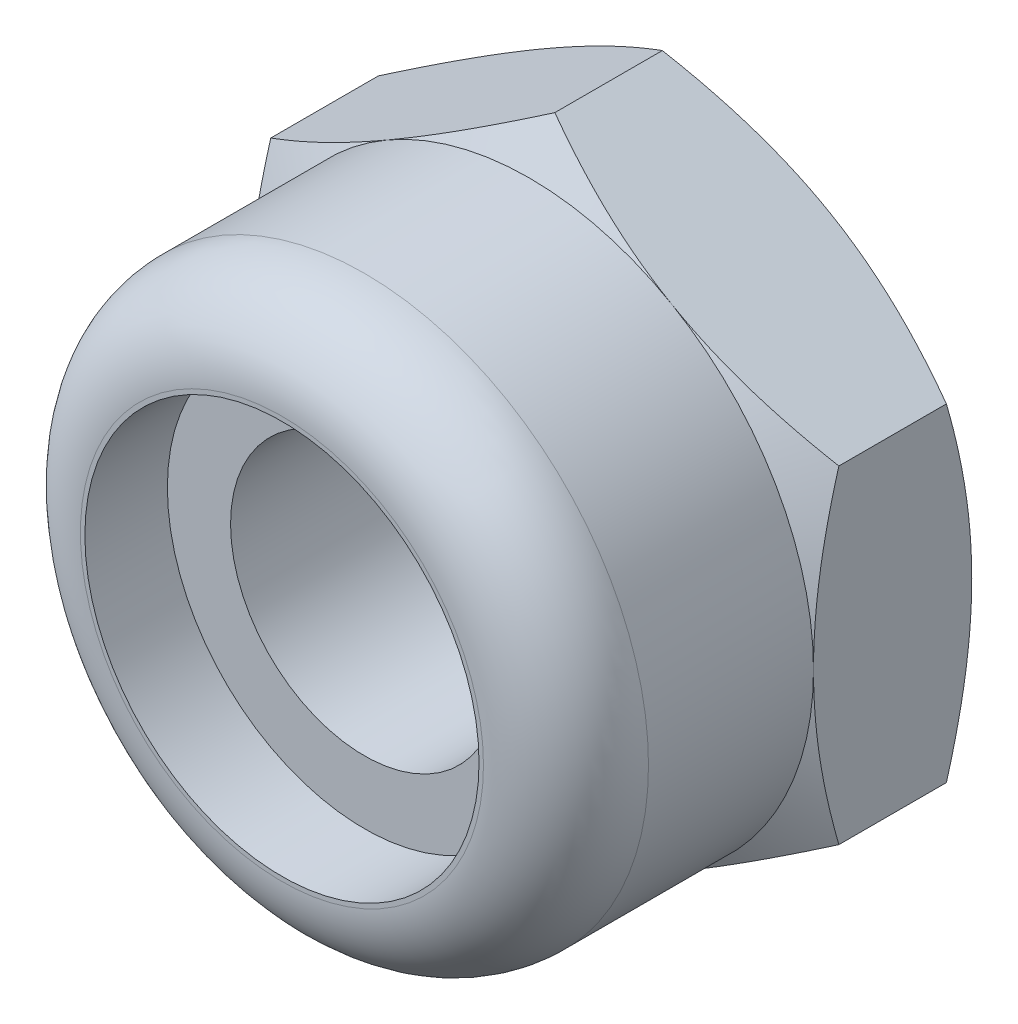
ISO-10303-21;
HEADER;
FILE_DESCRIPTION(('STEP AP214'),'2;1');
FILE_NAME('part.step','',(''),(''),'','','');
FILE_SCHEMA(('AUTOMOTIVE_DESIGN { 1 0 10303 214 1 1 1 1 }'));
ENDSEC;
DATA;
#1=APPLICATION_CONTEXT('core data for automotive mechanical design processes');
#2=APPLICATION_PROTOCOL_DEFINITION('international standard','automotive_design',2000,#1);
#3=PRODUCT_CONTEXT('',#1,'mechanical');
#4=PRODUCT('Part','Part','',(#3));
#5=PRODUCT_RELATED_PRODUCT_CATEGORY('part','',(#4));
#6=PRODUCT_DEFINITION_FORMATION('','',#4);
#7=PRODUCT_DEFINITION_CONTEXT('part definition',#1,'design');
#8=PRODUCT_DEFINITION('design','',#6,#7);
#9=PRODUCT_DEFINITION_SHAPE('','',#8);
#10=(LENGTH_UNIT() NAMED_UNIT(*) SI_UNIT(.MILLI.,.METRE.));
#11=(NAMED_UNIT(*) PLANE_ANGLE_UNIT() SI_UNIT($,.RADIAN.));
#12=(NAMED_UNIT(*) SI_UNIT($,.STERADIAN.) SOLID_ANGLE_UNIT());
#13=UNCERTAINTY_MEASURE_WITH_UNIT(LENGTH_MEASURE(1.E-05),#10,'distance_accuracy_value','');
#14=(GEOMETRIC_REPRESENTATION_CONTEXT(3) GLOBAL_UNCERTAINTY_ASSIGNED_CONTEXT((#13)) GLOBAL_UNIT_ASSIGNED_CONTEXT((#10,
#11,#12)) REPRESENTATION_CONTEXT('',''));
#15=CARTESIAN_POINT('',(0.,0.,0.));
#16=DIRECTION('',(0.,0.,1.));
#17=DIRECTION('',(1.,0.,0.));
#18=AXIS2_PLACEMENT_3D('',#15,#16,#17);
#19=CARTESIAN_POINT('',(0.,0.,-1.95));
#20=DIRECTION('',(0.,0.,1.));
#21=DIRECTION('',(1.,0.,0.));
#22=AXIS2_PLACEMENT_3D('',#19,#20,#21);
#23=CYLINDRICAL_SURFACE('',#22,1.65);
#24=CARTESIAN_POINT('',(0.,0.,2.033333333333));
#25=DIRECTION('',(0.,0.,1.));
#26=DIRECTION('',(1.,0.,0.));
#27=AXIS2_PLACEMENT_3D('',#24,#25,#26);
#28=CIRCLE('',#27,1.65);
#29=CARTESIAN_POINT('',(1.65,0.,2.033333333333));
#30=VERTEX_POINT('',#29);
#31=EDGE_CURVE('E285',#30,#30,#28,.T.);
#32=ORIENTED_EDGE('',*,*,#31,.T.);
#33=EDGE_LOOP('',(#32));
#34=FACE_BOUND('',#33,.T.);
#35=CARTESIAN_POINT('',(0.,0.,-1.6795273616266));
#36=DIRECTION('',(0.,0.,-1.));
#37=DIRECTION('',(-1.,0.,0.));
#38=AXIS2_PLACEMENT_3D('',#35,#36,#37);
#39=CIRCLE('',#38,1.65);
#40=CARTESIAN_POINT('',(-1.65,0.,-1.6795273616266));
#41=VERTEX_POINT('',#40);
#42=EDGE_CURVE('E44',#41,#41,#39,.F.);
#43=ORIENTED_EDGE('',*,*,#42,.F.);
#44=EDGE_LOOP('',(#43));
#45=FACE_BOUND('',#44,.T.);
#46=ADVANCED_FACE('F39',(#34,#45),#23,.F.);
#47=CARTESIAN_POINT('',(0.,4.04145188432738,-1.95));
#48=DIRECTION('',(-0.500000000000001,0.866025403784438,0.));
#49=DIRECTION('',(-0.866025403784438,-0.500000000000001,0.));
#50=AXIS2_PLACEMENT_3D('',#47,#48,#49);
#51=PLANE('',#50);
#52=DIRECTION('',(0.,0.,1.));
#53=VECTOR('',#52,1.);
#54=CARTESIAN_POINT('',(-3.5,2.02072594216369,-1.95));
#55=LINE('',#54,#53);
#56=CARTESIAN_POINT('',(-3.5,2.02072594216369,-1.63739260883035));
#57=VERTEX_POINT('',#56);
#58=CARTESIAN_POINT('',(-3.5,2.02072594216369,-0.312607391169643));
#59=VERTEX_POINT('',#58);
#60=EDGE_CURVE('E258',#57,#59,#55,.T.);
#61=ORIENTED_EDGE('',*,*,#60,.T.);
#62=CARTESIAN_POINT('',(-3.5002,2.02061047210985,-0.312674060693371));
#63=CARTESIAN_POINT('',(-3.34639282154755,2.10941108799267,-0.261385788989984));
#64=CARTESIAN_POINT('',(-3.19125798916558,2.19897822522909,-0.214740953816197));
#65=CARTESIAN_POINT('',(-2.87830199342322,2.37966345361545,-0.133321875533349));
#66=CARTESIAN_POINT('',(-2.7204752692125,2.47078475532382,-0.0985764355845609));
#67=CARTESIAN_POINT('',(-2.40677778961987,2.65189807961073,-0.0444900271828354));
#68=CARTESIAN_POINT('',(-2.25095530083931,2.74186223545399,-0.0247890862603809));
#69=CARTESIAN_POINT('',(-1.93857711279463,2.92221386641056,-0.00127013273725393));
#70=CARTESIAN_POINT('',(-1.78202254896577,3.01260068598001,0.00256735545443503));
#71=CARTESIAN_POINT('',(-1.48949078007901,3.1814939814933,-0.00541530187697759));
#72=CARTESIAN_POINT('',(-1.35346978754209,3.26002573814993,-0.0152754340696071));
#73=CARTESIAN_POINT('',(-1.08231397971101,3.41657761679354,-0.0465264668994038));
#74=CARTESIAN_POINT('',(-0.947180102315317,3.49459719728458,-0.0679280432857987));
#75=CARTESIAN_POINT('',(-0.675465207594816,3.65147186489429,-0.121430407880578));
#76=CARTESIAN_POINT('',(-0.538918580721664,3.73030709667644,-0.153757994445088));
#77=CARTESIAN_POINT('',(-0.267861907055498,3.88680174018324,-0.227128933807996));
#78=CARTESIAN_POINT('',(-0.133348387531463,3.96446315689009,-0.268155046569868));
#79=CARTESIAN_POINT('',(0.000200000000000561,4.04156735438122,-0.312674060693373));
#80=B_SPLINE_CURVE_WITH_KNOTS('',3,(#62,#63,#64,#65,#66,#67,#68,#69,#70,#71,#72,#73,#74,#75,#76,
#77,#78,#79),.UNSPECIFIED.,.F.,.F.,(4,2,2,2,2,2,2,2,4),(0.,0.554793832886254,1.11092123814984,
1.65328467083219,2.19498204478403,2.6666513085086,3.13875761298267,3.6213361260051,
4.10296698719187),.UNSPECIFIED.);
#81=CARTESIAN_POINT('',(-1.75,3.03108891324553,0.));
#82=VERTEX_POINT('',#81);
#83=EDGE_CURVE('E64',#59,#82,#80,.T.);
#84=ORIENTED_EDGE('',*,*,#83,.T.);
#85=CARTESIAN_POINT('',(0.,4.04145188432738,-0.312607391169645));
#86=VERTEX_POINT('',#85);
#87=EDGE_CURVE('E207',#82,#86,#80,.T.);
#88=ORIENTED_EDGE('',*,*,#87,.T.);
#89=DIRECTION('',(0.,0.,1.));
#90=VECTOR('',#89,1.);
#91=CARTESIAN_POINT('',(0.,4.04145188432738,-1.95));
#92=LINE('',#91,#90);
#93=CARTESIAN_POINT('',(0.,4.04145188432738,-1.63739260883035));
#94=VERTEX_POINT('',#93);
#95=EDGE_CURVE('E244',#94,#86,#92,.T.);
#96=ORIENTED_EDGE('',*,*,#95,.F.);
#97=CARTESIAN_POINT('',(-3.5002,2.02061047210985,-1.63732593930663));
#98=CARTESIAN_POINT('',(-3.34639282154755,2.10941108799267,-1.68861421101002));
#99=CARTESIAN_POINT('',(-3.19125798916558,2.19897822522909,-1.7352590461838));
#100=CARTESIAN_POINT('',(-2.87830199342322,2.37966345361545,-1.81667812446665));
#101=CARTESIAN_POINT('',(-2.7204752692125,2.47078475532382,-1.85142356441544));
#102=CARTESIAN_POINT('',(-2.40677778961987,2.65189807961073,-1.90550997281716));
#103=CARTESIAN_POINT('',(-2.25095530083931,2.74186223545399,-1.92521091373962));
#104=CARTESIAN_POINT('',(-1.93857711279463,2.92221386641056,-1.94872986726275));
#105=CARTESIAN_POINT('',(-1.78202254896577,3.01260068598001,-1.95256735545444));
#106=CARTESIAN_POINT('',(-1.48949078007901,3.1814939814933,-1.94458469812302));
#107=CARTESIAN_POINT('',(-1.35346978754209,3.26002573814993,-1.93472456593039));
#108=CARTESIAN_POINT('',(-1.08231397971101,3.41657761679354,-1.9034735331006));
#109=CARTESIAN_POINT('',(-0.947180102315317,3.49459719728458,-1.8820719567142));
#110=CARTESIAN_POINT('',(-0.675465207594816,3.65147186489429,-1.82856959211942));
#111=CARTESIAN_POINT('',(-0.538918580721664,3.73030709667644,-1.79624200555491));
#112=CARTESIAN_POINT('',(-0.267861907055498,3.88680174018324,-1.722871066192));
#113=CARTESIAN_POINT('',(-0.133348387531463,3.96446315689009,-1.68184495343013));
#114=CARTESIAN_POINT('',(0.000200000000000564,4.04156735438122,-1.63732593930663));
#115=B_SPLINE_CURVE_WITH_KNOTS('',3,(#97,#98,#99,#100,#101,#102,#103,#104,#105,#106,#107,#108,
#109,#110,#111,#112,#113,#114),.UNSPECIFIED.,.F.,.F.,(4,2,2,2,2,2,2,2,4),(0.,0.554793832886254,
1.11092123814984,1.65328467083219,2.19498204478403,2.6666513085086,3.13875761298267,
3.6213361260051,4.10296698719187),.UNSPECIFIED.);
#116=CARTESIAN_POINT('',(-1.75,3.03108891324553,-1.95));
#117=VERTEX_POINT('',#116);
#118=EDGE_CURVE('E260',#117,#94,#115,.T.);
#119=ORIENTED_EDGE('',*,*,#118,.F.);
#120=EDGE_CURVE('E238',#57,#117,#115,.T.);
#121=ORIENTED_EDGE('',*,*,#120,.F.);
#122=EDGE_LOOP('',(#61,#84,#88,#96,#119,#121));
#123=FACE_BOUND('',#122,.T.);
#124=ADVANCED_FACE('F41',(#123),#51,.T.);
#125=CARTESIAN_POINT('',(3.5,2.02072594216369,-1.95));
#126=DIRECTION('',(0.500000000000001,0.866025403784438,0.));
#127=DIRECTION('',(-0.866025403784438,0.500000000000001,0.));
#128=AXIS2_PLACEMENT_3D('',#125,#126,#127);
#129=PLANE('',#128);
#130=ORIENTED_EDGE('',*,*,#95,.T.);
#131=CARTESIAN_POINT('',(-0.000199999999999286,4.04156735438122,-0.312674060693373));
#132=CARTESIAN_POINT('',(0.15360717845245,3.9527667384984,-0.261385788989985));
#133=CARTESIAN_POINT('',(0.308742010834425,3.86319960126198,-0.214740953816199));
#134=CARTESIAN_POINT('',(0.621698006576782,3.68251437287562,-0.13332187553335));
#135=CARTESIAN_POINT('',(0.779524730787497,3.59139307116725,-0.098576435584562));
#136=CARTESIAN_POINT('',(1.09322221038013,3.41027974688034,-0.044490027182836));
#137=CARTESIAN_POINT('',(1.24904469916069,3.32031559103708,-0.0247890862603812));
#138=CARTESIAN_POINT('',(1.56142288720538,3.13996396008051,-0.00127013273725366));
#139=CARTESIAN_POINT('',(1.71797745103423,3.04957714051106,0.00256735545443554));
#140=CARTESIAN_POINT('',(2.01050921992099,2.88068384499777,-0.00541530187697695));
#141=CARTESIAN_POINT('',(2.14653021245791,2.80215208834114,-0.0152754340696064));
#142=CARTESIAN_POINT('',(2.417686020289,2.64560020969753,-0.0465264668994028));
#143=CARTESIAN_POINT('',(2.55281989768468,2.56758062920649,-0.0679280432857974));
#144=CARTESIAN_POINT('',(2.82453479240518,2.41070596159678,-0.121430407880577));
#145=CARTESIAN_POINT('',(2.96108141927834,2.33187072981463,-0.153757994445086));
#146=CARTESIAN_POINT('',(3.2321380929445,2.17537608630783,-0.227128933807994));
#147=CARTESIAN_POINT('',(3.36665161246854,2.09771466960098,-0.268155046569867));
#148=CARTESIAN_POINT('',(3.5002,2.02061047210985,-0.312674060693371));
#149=B_SPLINE_CURVE_WITH_KNOTS('',3,(#131,#132,#133,#134,#135,#136,#137,#138,#139,#140,#141,
#142,#143,#144,#145,#146,#147,#148),.UNSPECIFIED.,.F.,.F.,(4,2,2,2,2,2,2,2,4),(0.,
0.554793832886254,1.11092123814984,1.65328467083219,2.19498204478403,2.6666513085086,
3.13875761298267,3.6213361260051,4.10296698719187),.UNSPECIFIED.);
#150=CARTESIAN_POINT('',(1.75,3.03108891324553,0.));
#151=VERTEX_POINT('',#150);
#152=EDGE_CURVE('E216',#86,#151,#149,.T.);
#153=ORIENTED_EDGE('',*,*,#152,.T.);
#154=CARTESIAN_POINT('',(3.5,2.02072594216369,-0.312607391169645));
#155=VERTEX_POINT('',#154);
#156=EDGE_CURVE('E208',#151,#155,#149,.T.);
#157=ORIENTED_EDGE('',*,*,#156,.T.);
#158=DIRECTION('',(0.,0.,1.));
#159=VECTOR('',#158,1.);
#160=CARTESIAN_POINT('',(3.5,2.02072594216369,-1.95));
#161=LINE('',#160,#159);
#162=CARTESIAN_POINT('',(3.5,2.02072594216369,-1.63739260883035));
#163=VERTEX_POINT('',#162);
#164=EDGE_CURVE('E248',#163,#155,#161,.T.);
#165=ORIENTED_EDGE('',*,*,#164,.F.);
#166=CARTESIAN_POINT('',(-0.000199999999999315,4.04156735438122,-1.63732593930663));
#167=CARTESIAN_POINT('',(0.15360717845245,3.9527667384984,-1.68861421101001));
#168=CARTESIAN_POINT('',(0.308742010834425,3.86319960126198,-1.7352590461838));
#169=CARTESIAN_POINT('',(0.621698006576782,3.68251437287562,-1.81667812446665));
#170=CARTESIAN_POINT('',(0.779524730787497,3.59139307116725,-1.85142356441544));
#171=CARTESIAN_POINT('',(1.09322221038013,3.41027974688034,-1.90550997281716));
#172=CARTESIAN_POINT('',(1.24904469916069,3.32031559103708,-1.92521091373962));
#173=CARTESIAN_POINT('',(1.56142288720538,3.13996396008051,-1.94872986726275));
#174=CARTESIAN_POINT('',(1.71797745103423,3.04957714051106,-1.95256735545444));
#175=CARTESIAN_POINT('',(2.01050921992099,2.88068384499777,-1.94458469812302));
#176=CARTESIAN_POINT('',(2.14653021245791,2.80215208834114,-1.93472456593039));
#177=CARTESIAN_POINT('',(2.417686020289,2.64560020969753,-1.9034735331006));
#178=CARTESIAN_POINT('',(2.55281989768468,2.56758062920649,-1.8820719567142));
#179=CARTESIAN_POINT('',(2.82453479240518,2.41070596159678,-1.82856959211942));
#180=CARTESIAN_POINT('',(2.96108141927834,2.33187072981463,-1.79624200555491));
#181=CARTESIAN_POINT('',(3.2321380929445,2.17537608630783,-1.72287106619201));
#182=CARTESIAN_POINT('',(3.36665161246854,2.09771466960098,-1.68184495343013));
#183=CARTESIAN_POINT('',(3.5002,2.02061047210985,-1.63732593930663));
#184=B_SPLINE_CURVE_WITH_KNOTS('',3,(#166,#167,#168,#169,#170,#171,#172,#173,#174,#175,#176,
#177,#178,#179,#180,#181,#182,#183),.UNSPECIFIED.,.F.,.F.,(4,2,2,2,2,2,2,2,4),(0.,
0.554793832886254,1.11092123814984,1.65328467083219,2.19498204478403,2.6666513085086,
3.13875761298267,3.6213361260051,4.10296698719187),.UNSPECIFIED.);
#185=CARTESIAN_POINT('',(1.75,3.03108891324553,-1.95));
#186=VERTEX_POINT('',#185);
#187=EDGE_CURVE('E229',#186,#163,#184,.T.);
#188=ORIENTED_EDGE('',*,*,#187,.F.);
#189=EDGE_CURVE('E236',#94,#186,#184,.T.);
#190=ORIENTED_EDGE('',*,*,#189,.F.);
#191=EDGE_LOOP('',(#130,#153,#157,#165,#188,#190));
#192=FACE_BOUND('',#191,.T.);
#193=ADVANCED_FACE('F219',(#192),#129,.T.);
#194=CARTESIAN_POINT('',(3.5,2.02072594216369,-1.95));
#195=DIRECTION('',(-1.,0.,0.));
#196=DIRECTION('',(0.,0.,1.));
#197=AXIS2_PLACEMENT_3D('',#194,#195,#196);
#198=PLANE('',#197);
#199=CARTESIAN_POINT('',(3.5,-5.35926299121406,-1.67484346858556));
#200=CARTESIAN_POINT('',(3.5,-5.20559319908842,-1.60058173692104));
#201=CARTESIAN_POINT('',(3.5,-5.05156008083376,-1.52705822833148));
#202=CARTESIAN_POINT('',(3.5,-4.7425707418071,-1.38190950344752));
#203=CARTESIAN_POINT('',(3.5,-4.58761436682437,-1.31028461582133));
#204=CARTESIAN_POINT('',(3.5,-4.27574500225542,-1.16897765517624));
#205=CARTESIAN_POINT('',(3.5,-4.11882589028192,-1.09930904568016));
#206=CARTESIAN_POINT('',(3.5,-3.80369792903856,-0.962964262242764));
#207=CARTESIAN_POINT('',(3.5,-3.64548914750596,-0.896287932319521));
#208=CARTESIAN_POINT('',(3.5,-3.32556618401856,-0.765931819095069));
#209=CARTESIAN_POINT('',(3.5,-3.16383281219924,-0.702298873688867));
#210=CARTESIAN_POINT('',(3.5,-2.83845840945598,-0.580016702089494));
#211=CARTESIAN_POINT('',(3.5,-2.67481716858826,-0.521368030370693));
#212=CARTESIAN_POINT('',(3.5,-2.3457027847205,-0.410630279877023));
#213=CARTESIAN_POINT('',(3.5,-2.18023438248743,-0.358527255435859));
#214=CARTESIAN_POINT('',(3.5,-1.8469452280637,-0.262572936976444));
#215=CARTESIAN_POINT('',(3.5,-1.6791252378753,-0.218719033467158));
#216=CARTESIAN_POINT('',(3.5,-1.34101828610925,-0.141391945584787));
#217=CARTESIAN_POINT('',(3.5,-1.17073068027694,-0.107921525211973));
#218=CARTESIAN_POINT('',(3.5,-0.828102385138485,-0.0536149564320504));
#219=CARTESIAN_POINT('',(3.5,-0.655761694017302,-0.0327788191952365));
#220=CARTESIAN_POINT('',(3.5,-0.31102049092445,-0.00558408650575669));
#221=CARTESIAN_POINT('',(3.5,-0.13862739720726,0.00086616316591122));
#222=CARTESIAN_POINT('',(3.5,0.206038074906534,-0.00105355807794606));
#223=CARTESIAN_POINT('',(3.5,0.378310473023179,-0.00941968196343173));
#224=CARTESIAN_POINT('',(3.5,0.672490555822326,-0.0357688927868919));
#225=CARTESIAN_POINT('',(3.5,0.794722791084091,-0.0503206340384212));
#226=CARTESIAN_POINT('',(3.5,1.0382430543056,-0.0859367340533556));
#227=CARTESIAN_POINT('',(3.5,1.15953093025886,-0.107002119926141));
#228=CARTESIAN_POINT('',(3.5,1.52187914771348,-0.178863187081452));
#229=CARTESIAN_POINT('',(3.5,1.76124104212632,-0.23830527562201));
#230=CARTESIAN_POINT('',(3.5,2.11940971387708,-0.340826814402553));
#231=CARTESIAN_POINT('',(3.5,2.24008344316346,-0.377749699085182));
#232=CARTESIAN_POINT('',(3.5,2.48017139213728,-0.455249007699292));
#233=CARTESIAN_POINT('',(3.5,2.59958641795612,-0.495822911663549));
#234=CARTESIAN_POINT('',(3.5,2.83665760451798,-0.579779986782752));
#235=CARTESIAN_POINT('',(3.5,2.95431988203483,-0.623146060034313));
#236=CARTESIAN_POINT('',(3.5,3.188731535088,-0.712423559566865));
#237=CARTESIAN_POINT('',(3.5,3.30548051959464,-0.758336014592949));
#238=CARTESIAN_POINT('',(3.5,3.42180736613349,-0.80527038072407));
#239=B_SPLINE_CURVE_WITH_KNOTS('',3,(#199,#200,#201,#202,#203,#204,#205,#206,#207,#208,#209,
#210,#211,#212,#213,#214,#215,#216,#217,#218,#219,#220,#221,#222,#223,#224,#225,#226,#227,#228,
#229,#230,#231,#232,#233,#234,#235,#236,#237,#238),.UNSPECIFIED.,.F.,.F.,(4,2,2,2,2,2,2,2,2,2,2,
2,2,2,2,2,2,2,2,4),(0.,0.512025318465737,1.02413870177436,1.53918270315241,2.05419982499223,
2.57553975872798,3.09693761309353,3.617205066104,4.13730766217537,4.65754858684365,
5.17778997146961,5.69470725122282,6.21149033452401,6.58059623222331,6.94976036239485,
7.68863804939851,8.06719621660478,8.4454950747676,8.82166461280099,9.1979872473341),.UNSPECIFIED.);
#240=CARTESIAN_POINT('',(3.5,-2.0207259421637,-0.312607391169645));
#241=VERTEX_POINT('',#240);
#242=CARTESIAN_POINT('',(3.5,0.,0.));
#243=VERTEX_POINT('',#242);
#244=EDGE_CURVE('E195',#241,#243,#239,.T.);
#245=ORIENTED_EDGE('',*,*,#244,.F.);
#246=DIRECTION('',(0.,0.,1.));
#247=VECTOR('',#246,1.);
#248=CARTESIAN_POINT('',(3.5,-2.0207259421637,-1.95));
#249=LINE('',#248,#247);
#250=CARTESIAN_POINT('',(3.5,-2.0207259421637,-1.63739260883035));
#251=VERTEX_POINT('',#250);
#252=EDGE_CURVE('E251',#251,#241,#249,.T.);
#253=ORIENTED_EDGE('',*,*,#252,.F.);
#254=CARTESIAN_POINT('',(3.5,-5.35926299121406,-0.275156531414437));
#255=CARTESIAN_POINT('',(3.5,-5.20559319908842,-0.34941826307896));
#256=CARTESIAN_POINT('',(3.5,-5.05156008083376,-0.422941771668524));
#257=CARTESIAN_POINT('',(3.5,-4.7425707418071,-0.568090496552479));
#258=CARTESIAN_POINT('',(3.5,-4.58761436682437,-0.63971538417867));
#259=CARTESIAN_POINT('',(3.5,-4.27574500225542,-0.781022344823759));
#260=CARTESIAN_POINT('',(3.5,-4.11882589028192,-0.850690954319838));
#261=CARTESIAN_POINT('',(3.5,-3.80369792903856,-0.987035737757236));
#262=CARTESIAN_POINT('',(3.5,-3.64548914750596,-1.05371206768048));
#263=CARTESIAN_POINT('',(3.5,-3.32556618401856,-1.18406818090493));
#264=CARTESIAN_POINT('',(3.5,-3.16383281219924,-1.24770112631113));
#265=CARTESIAN_POINT('',(3.5,-2.83845840945598,-1.36998329791051));
#266=CARTESIAN_POINT('',(3.5,-2.67481716858826,-1.42863196962931));
#267=CARTESIAN_POINT('',(3.5,-2.3457027847205,-1.53936972012298));
#268=CARTESIAN_POINT('',(3.5,-2.18023438248743,-1.59147274456414));
#269=CARTESIAN_POINT('',(3.5,-1.8469452280637,-1.68742706302356));
#270=CARTESIAN_POINT('',(3.5,-1.6791252378753,-1.73128096653284));
#271=CARTESIAN_POINT('',(3.5,-1.34101828610925,-1.80860805441521));
#272=CARTESIAN_POINT('',(3.5,-1.17073068027694,-1.84207847478803));
#273=CARTESIAN_POINT('',(3.5,-0.828102385138485,-1.89638504356795));
#274=CARTESIAN_POINT('',(3.5,-0.655761694017302,-1.91722118080476));
#275=CARTESIAN_POINT('',(3.5,-0.31102049092445,-1.94441591349424));
#276=CARTESIAN_POINT('',(3.5,-0.13862739720726,-1.95086616316591));
#277=CARTESIAN_POINT('',(3.5,0.206038074906535,-1.94894644192205));
#278=CARTESIAN_POINT('',(3.5,0.378310473023179,-1.94058031803657));
#279=CARTESIAN_POINT('',(3.5,0.672490555822326,-1.91423110721311));
#280=CARTESIAN_POINT('',(3.5,0.794722791084091,-1.89967936596158));
#281=CARTESIAN_POINT('',(3.5,1.0382430543056,-1.86406326594664));
#282=CARTESIAN_POINT('',(3.5,1.15953093025886,-1.84299788007386));
#283=CARTESIAN_POINT('',(3.5,1.52187914771348,-1.77113681291855));
#284=CARTESIAN_POINT('',(3.5,1.76124104212632,-1.71169472437799));
#285=CARTESIAN_POINT('',(3.5,2.11940971387708,-1.60917318559745));
#286=CARTESIAN_POINT('',(3.5,2.24008344316346,-1.57225030091482));
#287=CARTESIAN_POINT('',(3.5,2.48017139213728,-1.49475099230071));
#288=CARTESIAN_POINT('',(3.5,2.59958641795612,-1.45417708833645));
#289=CARTESIAN_POINT('',(3.5,2.83665760451798,-1.37022001321725));
#290=CARTESIAN_POINT('',(3.5,2.95431988203483,-1.32685393996569));
#291=CARTESIAN_POINT('',(3.5,3.188731535088,-1.23757644043314));
#292=CARTESIAN_POINT('',(3.5,3.30548051959464,-1.19166398540705));
#293=CARTESIAN_POINT('',(3.5,3.42180736613349,-1.14472961927593));
#294=B_SPLINE_CURVE_WITH_KNOTS('',3,(#254,#255,#256,#257,#258,#259,#260,#261,#262,#263,#264,
#265,#266,#267,#268,#269,#270,#271,#272,#273,#274,#275,#276,#277,#278,#279,#280,#281,#282,#283,
#284,#285,#286,#287,#288,#289,#290,#291,#292,#293),.UNSPECIFIED.,.F.,.F.,(4,2,2,2,2,2,2,2,2,2,2,
2,2,2,2,2,2,2,2,4),(0.,0.512025318465737,1.02413870177436,1.53918270315241,2.05419982499223,
2.57553975872798,3.09693761309353,3.617205066104,4.13730766217537,4.65754858684365,
5.17778997146961,5.69470725122282,6.21149033452401,6.58059623222331,6.94976036239485,
7.68863804939851,8.06719621660478,8.4454950747676,8.82166461280099,9.1979872473341),.UNSPECIFIED.);
#295=CARTESIAN_POINT('',(3.5,0.,-1.95));
#296=VERTEX_POINT('',#295);
#297=EDGE_CURVE('E376',#251,#296,#294,.T.);
#298=ORIENTED_EDGE('',*,*,#297,.T.);
#299=EDGE_CURVE('E237',#296,#163,#294,.T.);
#300=ORIENTED_EDGE('',*,*,#299,.T.);
#301=ORIENTED_EDGE('',*,*,#164,.T.);
#302=EDGE_CURVE('E206',#243,#155,#239,.T.);
#303=ORIENTED_EDGE('',*,*,#302,.F.);
#304=EDGE_LOOP('',(#245,#253,#298,#300,#301,#303));
#305=FACE_BOUND('',#304,.T.);
#306=ADVANCED_FACE('F223',(#305),#198,.F.);
#307=CARTESIAN_POINT('',(0.,-4.04145188432739,-1.95));
#308=DIRECTION('',(0.500000000000001,-0.866025403784438,0.));
#309=DIRECTION('',(0.866025403784438,0.500000000000001,0.));
#310=AXIS2_PLACEMENT_3D('',#307,#308,#309);
#311=PLANE('',#310);
#312=ORIENTED_EDGE('',*,*,#252,.T.);
#313=CARTESIAN_POINT('',(3.5002,-2.02061047210986,-0.312674060693373));
#314=CARTESIAN_POINT('',(3.34639282154755,-2.10941108799268,-0.261385788989985));
#315=CARTESIAN_POINT('',(3.19125798916558,-2.1989782252291,-0.214740953816199));
#316=CARTESIAN_POINT('',(2.87830199342322,-2.37966345361545,-0.133321875533351));
#317=CARTESIAN_POINT('',(2.7204752692125,-2.47078475532383,-0.0985764355845633));
#318=CARTESIAN_POINT('',(2.40677778961987,-2.65189807961074,-0.044490027182838));
#319=CARTESIAN_POINT('',(2.25095530083931,-2.741862235454,-0.0247890862603835));
#320=CARTESIAN_POINT('',(1.93857711279462,-2.92221386641056,-0.00127013273725662));
#321=CARTESIAN_POINT('',(1.78202254896577,-3.01260068598002,0.00256735545443221));
#322=CARTESIAN_POINT('',(1.48949078007901,-3.18149398149331,-0.00541530187698086));
#323=CARTESIAN_POINT('',(1.35346978754209,-3.26002573814994,-0.0152754340696106));
#324=CARTESIAN_POINT('',(1.082313979711,-3.41657761679354,-0.0465264668994075));
#325=CARTESIAN_POINT('',(0.947180102315316,-3.49459719728458,-0.0679280432858023));
#326=CARTESIAN_POINT('',(0.675465207594815,-3.65147186489429,-0.121430407880581));
#327=CARTESIAN_POINT('',(0.538918580721664,-3.73030709667644,-0.153757994445092));
#328=CARTESIAN_POINT('',(0.267861907055498,-3.88680174018325,-0.227128933807999));
#329=CARTESIAN_POINT('',(0.133348387531463,-3.9644631568901,-0.268155046569872));
#330=CARTESIAN_POINT('',(-0.000200000000000154,-4.04156735438123,-0.312674060693376));
#331=B_SPLINE_CURVE_WITH_KNOTS('',3,(#313,#314,#315,#316,#317,#318,#319,#320,#321,#322,#323,
#324,#325,#326,#327,#328,#329,#330),.UNSPECIFIED.,.F.,.F.,(4,2,2,2,2,2,2,2,4),(0.,
0.554793832886255,1.11092123814984,1.65328467083219,2.19498204478403,2.6666513085086,
3.13875761298267,3.6213361260051,4.10296698719187),.UNSPECIFIED.);
#332=CARTESIAN_POINT('',(1.75,-3.03108891324553,0.));
#333=VERTEX_POINT('',#332);
#334=EDGE_CURVE('E370',#241,#333,#331,.T.);
#335=ORIENTED_EDGE('',*,*,#334,.T.);
#336=CARTESIAN_POINT('',(0.,-4.04145188432738,-0.312607391169645));
#337=VERTEX_POINT('',#336);
#338=EDGE_CURVE('E188',#333,#337,#331,.T.);
#339=ORIENTED_EDGE('',*,*,#338,.T.);
#340=DIRECTION('',(0.,0.,1.));
#341=VECTOR('',#340,1.);
#342=CARTESIAN_POINT('',(0.,-4.04145188432739,-1.95));
#343=LINE('',#342,#341);
#344=CARTESIAN_POINT('',(0.,-4.04145188432738,-1.63739260883035));
#345=VERTEX_POINT('',#344);
#346=EDGE_CURVE('E254',#345,#337,#343,.T.);
#347=ORIENTED_EDGE('',*,*,#346,.F.);
#348=CARTESIAN_POINT('',(3.5002,-2.02061047210986,-1.63732593930663));
#349=CARTESIAN_POINT('',(3.34639282154755,-2.10941108799268,-1.68861421101001));
#350=CARTESIAN_POINT('',(3.19125798916558,-2.1989782252291,-1.7352590461838));
#351=CARTESIAN_POINT('',(2.87830199342322,-2.37966345361545,-1.81667812446665));
#352=CARTESIAN_POINT('',(2.7204752692125,-2.47078475532383,-1.85142356441544));
#353=CARTESIAN_POINT('',(2.40677778961987,-2.65189807961074,-1.90550997281716));
#354=CARTESIAN_POINT('',(2.25095530083931,-2.741862235454,-1.92521091373962));
#355=CARTESIAN_POINT('',(1.93857711279463,-2.92221386641056,-1.94872986726274));
#356=CARTESIAN_POINT('',(1.78202254896577,-3.01260068598002,-1.95256735545443));
#357=CARTESIAN_POINT('',(1.48949078007901,-3.18149398149331,-1.94458469812302));
#358=CARTESIAN_POINT('',(1.35346978754209,-3.26002573814994,-1.93472456593039));
#359=CARTESIAN_POINT('',(1.082313979711,-3.41657761679354,-1.90347353310059));
#360=CARTESIAN_POINT('',(0.947180102315316,-3.49459719728458,-1.8820719567142));
#361=CARTESIAN_POINT('',(0.675465207594815,-3.6514718648943,-1.82856959211942));
#362=CARTESIAN_POINT('',(0.538918580721663,-3.73030709667644,-1.79624200555491));
#363=CARTESIAN_POINT('',(0.267861907055498,-3.88680174018325,-1.722871066192));
#364=CARTESIAN_POINT('',(0.133348387531463,-3.9644631568901,-1.68184495343013));
#365=CARTESIAN_POINT('',(-0.000200000000000395,-4.04156735438123,-1.63732593930662));
#366=B_SPLINE_CURVE_WITH_KNOTS('',3,(#348,#349,#350,#351,#352,#353,#354,#355,#356,#357,#358,
#359,#360,#361,#362,#363,#364,#365),.UNSPECIFIED.,.F.,.F.,(4,2,2,2,2,2,2,2,4),(0.,
0.554793832886254,1.11092123814984,1.65328467083219,2.19498204478403,2.6666513085086,
3.13875761298267,3.6213361260051,4.10296698719187),.UNSPECIFIED.);
#367=CARTESIAN_POINT('',(1.75,-3.03108891324553,-1.95));
#368=VERTEX_POINT('',#367);
#369=EDGE_CURVE('E347',#368,#345,#366,.T.);
#370=ORIENTED_EDGE('',*,*,#369,.F.);
#371=EDGE_CURVE('E372',#251,#368,#366,.T.);
#372=ORIENTED_EDGE('',*,*,#371,.F.);
#373=EDGE_LOOP('',(#312,#335,#339,#347,#370,#372));
#374=FACE_BOUND('',#373,.T.);
#375=ADVANCED_FACE('F355',(#374),#311,.T.);
#376=CARTESIAN_POINT('',(-3.5,-2.02072594216369,-1.95));
#377=DIRECTION('',(-0.500000000000001,-0.866025403784438,0.));
#378=DIRECTION('',(0.866025403784438,-0.500000000000001,0.));
#379=AXIS2_PLACEMENT_3D('',#376,#377,#378);
#380=PLANE('',#379);
#381=ORIENTED_EDGE('',*,*,#346,.T.);
#382=CARTESIAN_POINT('',(0.000199999999999534,-4.04156735438123,-0.312674060693377));
#383=CARTESIAN_POINT('',(-0.15360717845245,-3.95276673849841,-0.261385788989989));
#384=CARTESIAN_POINT('',(-0.308742010834425,-3.86319960126199,-0.214740953816202));
#385=CARTESIAN_POINT('',(-0.621698006576783,-3.68251437287563,-0.133321875533353));
#386=CARTESIAN_POINT('',(-0.779524730787498,-3.59139307116726,-0.0985764355845653));
#387=CARTESIAN_POINT('',(-1.09322221038013,-3.41027974688034,-0.0444900271828393));
#388=CARTESIAN_POINT('',(-1.2490446991607,-3.32031559103708,-0.0247890862603844));
#389=CARTESIAN_POINT('',(-1.56142288720538,-3.13996396008052,-0.00127013273725695));
#390=CARTESIAN_POINT('',(-1.71797745103423,-3.04957714051106,0.0025673554544321));
#391=CARTESIAN_POINT('',(-2.01050921992099,-2.88068384499778,-0.0054153018769804));
#392=CARTESIAN_POINT('',(-2.14653021245791,-2.80215208834115,-0.0152754340696097));
#393=CARTESIAN_POINT('',(-2.417686020289,-2.64560020969754,-0.046526466899406));
#394=CARTESIAN_POINT('',(-2.55281989768469,-2.5675806292065,-0.0679280432858007));
#395=CARTESIAN_POINT('',(-2.82453479240519,-2.41070596159679,-0.121430407880579));
#396=CARTESIAN_POINT('',(-2.96108141927834,-2.33187072981464,-0.153757994445089));
#397=CARTESIAN_POINT('',(-3.2321380929445,-2.17537608630783,-0.227128933807996));
#398=CARTESIAN_POINT('',(-3.36665161246854,-2.09771466960099,-0.268155046569868));
#399=CARTESIAN_POINT('',(-3.5002,-2.02061047210986,-0.312674060693372));
#400=B_SPLINE_CURVE_WITH_KNOTS('',3,(#382,#383,#384,#385,#386,#387,#388,#389,#390,#391,#392,
#393,#394,#395,#396,#397,#398,#399),.UNSPECIFIED.,.F.,.F.,(4,2,2,2,2,2,2,2,4),(0.,
0.554793832886255,1.11092123814984,1.65328467083219,2.19498204478404,2.6666513085086,
3.13875761298268,3.6213361260051,4.10296698719187),.UNSPECIFIED.);
#401=CARTESIAN_POINT('',(-1.75,-3.03108891324553,0.));
#402=VERTEX_POINT('',#401);
#403=EDGE_CURVE('E155',#337,#402,#400,.T.);
#404=ORIENTED_EDGE('',*,*,#403,.T.);
#405=CARTESIAN_POINT('',(-3.5,-2.02072594216369,-0.312607391169645));
#406=VERTEX_POINT('',#405);
#407=EDGE_CURVE('E146',#402,#406,#400,.T.);
#408=ORIENTED_EDGE('',*,*,#407,.T.);
#409=DIRECTION('',(0.,0.,1.));
#410=VECTOR('',#409,1.);
#411=CARTESIAN_POINT('',(-3.5,-2.02072594216369,-1.95));
#412=LINE('',#411,#410);
#413=CARTESIAN_POINT('',(-3.5,-2.02072594216369,-1.63739260883035));
#414=VERTEX_POINT('',#413);
#415=EDGE_CURVE('E154',#414,#406,#412,.T.);
#416=ORIENTED_EDGE('',*,*,#415,.F.);
#417=CARTESIAN_POINT('',(0.000199999999999624,-4.04156735438123,-1.63732593930662));
#418=CARTESIAN_POINT('',(-0.153607178452451,-3.95276673849841,-1.68861421101001));
#419=CARTESIAN_POINT('',(-0.308742010834425,-3.86319960126199,-1.7352590461838));
#420=CARTESIAN_POINT('',(-0.621698006576783,-3.68251437287563,-1.81667812446665));
#421=CARTESIAN_POINT('',(-0.779524730787498,-3.59139307116726,-1.85142356441543));
#422=CARTESIAN_POINT('',(-1.09322221038013,-3.41027974688034,-1.90550997281716));
#423=CARTESIAN_POINT('',(-1.2490446991607,-3.32031559103708,-1.92521091373962));
#424=CARTESIAN_POINT('',(-1.56142288720538,-3.13996396008052,-1.94872986726274));
#425=CARTESIAN_POINT('',(-1.71797745103423,-3.04957714051106,-1.95256735545443));
#426=CARTESIAN_POINT('',(-2.01050921992099,-2.88068384499778,-1.94458469812302));
#427=CARTESIAN_POINT('',(-2.14653021245791,-2.80215208834115,-1.93472456593039));
#428=CARTESIAN_POINT('',(-2.417686020289,-2.64560020969754,-1.90347353310059));
#429=CARTESIAN_POINT('',(-2.55281989768468,-2.5675806292065,-1.8820719567142));
#430=CARTESIAN_POINT('',(-2.82453479240518,-2.41070596159679,-1.82856959211942));
#431=CARTESIAN_POINT('',(-2.96108141927834,-2.33187072981464,-1.79624200555491));
#432=CARTESIAN_POINT('',(-3.2321380929445,-2.17537608630783,-1.722871066192));
#433=CARTESIAN_POINT('',(-3.36665161246854,-2.09771466960099,-1.68184495343013));
#434=CARTESIAN_POINT('',(-3.5002,-2.02061047210986,-1.63732593930663));
#435=B_SPLINE_CURVE_WITH_KNOTS('',3,(#417,#418,#419,#420,#421,#422,#423,#424,#425,#426,#427,
#428,#429,#430,#431,#432,#433,#434),.UNSPECIFIED.,.F.,.F.,(4,2,2,2,2,2,2,2,4),(0.,
0.554793832886256,1.11092123814984,1.65328467083219,2.19498204478404,2.6666513085086,
3.13875761298268,3.6213361260051,4.10296698719187),.UNSPECIFIED.);
#436=CARTESIAN_POINT('',(-1.75,-3.03108891324553,-1.95));
#437=VERTEX_POINT('',#436);
#438=EDGE_CURVE('E334',#437,#414,#435,.T.);
#439=ORIENTED_EDGE('',*,*,#438,.F.);
#440=EDGE_CURVE('E346',#345,#437,#435,.T.);
#441=ORIENTED_EDGE('',*,*,#440,.F.);
#442=EDGE_LOOP('',(#381,#404,#408,#416,#439,#441));
#443=FACE_BOUND('',#442,.T.);
#444=ADVANCED_FACE('F352',(#443),#380,.T.);
#445=CARTESIAN_POINT('',(-3.5,2.02072594216369,-1.95));
#446=DIRECTION('',(-1.,0.,0.));
#447=DIRECTION('',(0.,0.,1.));
#448=AXIS2_PLACEMENT_3D('',#445,#446,#447);
#449=PLANE('',#448);
#450=ORIENTED_EDGE('',*,*,#415,.T.);
#451=CARTESIAN_POINT('',(-3.5,-5.35926299121406,-1.67484346858556));
#452=CARTESIAN_POINT('',(-3.5,-5.20559319908842,-1.60058173692104));
#453=CARTESIAN_POINT('',(-3.5,-5.05156008083375,-1.52705822833148));
#454=CARTESIAN_POINT('',(-3.5,-4.7425707418071,-1.38190950344752));
#455=CARTESIAN_POINT('',(-3.5,-4.58761436682437,-1.31028461582133));
#456=CARTESIAN_POINT('',(-3.5,-4.27574500225542,-1.16897765517624));
#457=CARTESIAN_POINT('',(-3.5,-4.11882589028192,-1.09930904568016));
#458=CARTESIAN_POINT('',(-3.5,-3.80369792903856,-0.962964262242762));
#459=CARTESIAN_POINT('',(-3.5,-3.64548914750596,-0.89628793231952));
#460=CARTESIAN_POINT('',(-3.5,-3.32556618401856,-0.765931819095069));
#461=CARTESIAN_POINT('',(-3.5,-3.16383281219924,-0.702298873688866));
#462=CARTESIAN_POINT('',(-3.5,-2.83845840945598,-0.580016702089494));
#463=CARTESIAN_POINT('',(-3.5,-2.67481716858826,-0.521368030370692));
#464=CARTESIAN_POINT('',(-3.5,-2.34570278472049,-0.410630279877022));
#465=CARTESIAN_POINT('',(-3.5,-2.18023438248743,-0.358527255435858));
#466=CARTESIAN_POINT('',(-3.5,-1.8469452280637,-0.262572936976443));
#467=CARTESIAN_POINT('',(-3.5,-1.6791252378753,-0.218719033467158));
#468=CARTESIAN_POINT('',(-3.5,-1.34101828610925,-0.141391945584787));
#469=CARTESIAN_POINT('',(-3.5,-1.17073068027693,-0.107921525211973));
#470=CARTESIAN_POINT('',(-3.5,-0.828102385138485,-0.0536149564320503));
#471=CARTESIAN_POINT('',(-3.5,-0.655761694017302,-0.0327788191952362));
#472=CARTESIAN_POINT('',(-3.5,-0.311020490924449,-0.00558408650575643));
#473=CARTESIAN_POINT('',(-3.5,-0.13862739720726,0.000866163165911362));
#474=CARTESIAN_POINT('',(-3.5,0.206038074906535,-0.0010535580779462));
#475=CARTESIAN_POINT('',(-3.5,0.378310473023179,-0.00941968196343204));
#476=CARTESIAN_POINT('',(-3.5,0.672490555822327,-0.0357688927868921));
#477=CARTESIAN_POINT('',(-3.5,0.794722791084092,-0.0503206340384212));
#478=CARTESIAN_POINT('',(-3.5,1.0382430543056,-0.0859367340533555));
#479=CARTESIAN_POINT('',(-3.5,1.15953093025887,-0.107002119926141));
#480=CARTESIAN_POINT('',(-3.5,1.52187914771348,-0.178863187081453));
#481=CARTESIAN_POINT('',(-3.5,1.76124104212632,-0.23830527562201));
#482=CARTESIAN_POINT('',(-3.5,2.11940971387708,-0.340826814402554));
#483=CARTESIAN_POINT('',(-3.5,2.24008344316346,-0.377749699085182));
#484=CARTESIAN_POINT('',(-3.5,2.48017139213728,-0.455249007699293));
#485=CARTESIAN_POINT('',(-3.5,2.59958641795613,-0.495822911663549));
#486=CARTESIAN_POINT('',(-3.5,2.83665760451798,-0.579779986782752));
#487=CARTESIAN_POINT('',(-3.5,2.95431988203483,-0.623146060034314));
#488=CARTESIAN_POINT('',(-3.5,3.188731535088,-0.712423559566866));
#489=CARTESIAN_POINT('',(-3.5,3.30548051959464,-0.75833601459295));
#490=CARTESIAN_POINT('',(-3.5,3.42180736613349,-0.80527038072407));
#491=B_SPLINE_CURVE_WITH_KNOTS('',3,(#451,#452,#453,#454,#455,#456,#457,#458,#459,#460,#461,
#462,#463,#464,#465,#466,#467,#468,#469,#470,#471,#472,#473,#474,#475,#476,#477,#478,#479,#480,
#481,#482,#483,#484,#485,#486,#487,#488,#489,#490),.UNSPECIFIED.,.F.,.F.,(4,2,2,2,2,2,2,2,2,2,2,
2,2,2,2,2,2,2,2,4),(0.,0.512025318465736,1.02413870177436,1.53918270315241,2.05419982499223,
2.57553975872798,3.09693761309353,3.617205066104,4.13730766217537,4.65754858684365,
5.17778997146961,5.69470725122282,6.21149033452401,6.58059623222331,6.94976036239485,
7.68863804939851,8.06719621660478,8.4454950747676,8.82166461280099,9.1979872473341),.UNSPECIFIED.);
#492=CARTESIAN_POINT('',(-3.5,0.,0.));
#493=VERTEX_POINT('',#492);
#494=EDGE_CURVE('E139',#406,#493,#491,.T.);
#495=ORIENTED_EDGE('',*,*,#494,.T.);
#496=EDGE_CURVE('E133',#493,#59,#491,.T.);
#497=ORIENTED_EDGE('',*,*,#496,.T.);
#498=ORIENTED_EDGE('',*,*,#60,.F.);
#499=CARTESIAN_POINT('',(-3.5,-5.35926299121406,-0.275156531414438));
#500=CARTESIAN_POINT('',(-3.5,-5.20559319908842,-0.349418263078961));
#501=CARTESIAN_POINT('',(-3.5,-5.05156008083375,-0.422941771668525));
#502=CARTESIAN_POINT('',(-3.5,-4.7425707418071,-0.56809049655248));
#503=CARTESIAN_POINT('',(-3.5,-4.58761436682437,-0.639715384178671));
#504=CARTESIAN_POINT('',(-3.5,-4.27574500225542,-0.781022344823761));
#505=CARTESIAN_POINT('',(-3.5,-4.11882589028192,-0.850690954319841));
#506=CARTESIAN_POINT('',(-3.5,-3.80369792903855,-0.987035737757239));
#507=CARTESIAN_POINT('',(-3.5,-3.64548914750595,-1.05371206768048));
#508=CARTESIAN_POINT('',(-3.5,-3.32556618401855,-1.18406818090493));
#509=CARTESIAN_POINT('',(-3.5,-3.16383281219924,-1.24770112631113));
#510=CARTESIAN_POINT('',(-3.5,-2.83845840945597,-1.36998329791051));
#511=CARTESIAN_POINT('',(-3.5,-2.67481716858826,-1.42863196962931));
#512=CARTESIAN_POINT('',(-3.5,-2.34570278472049,-1.53936972012298));
#513=CARTESIAN_POINT('',(-3.5,-2.18023438248742,-1.59147274456414));
#514=CARTESIAN_POINT('',(-3.5,-1.8469452280637,-1.68742706302356));
#515=CARTESIAN_POINT('',(-3.5,-1.6791252378753,-1.73128096653284));
#516=CARTESIAN_POINT('',(-3.5,-1.34101828610925,-1.80860805441521));
#517=CARTESIAN_POINT('',(-3.5,-1.17073068027693,-1.84207847478803));
#518=CARTESIAN_POINT('',(-3.5,-0.828102385138485,-1.89638504356795));
#519=CARTESIAN_POINT('',(-3.5,-0.655761694017302,-1.91722118080476));
#520=CARTESIAN_POINT('',(-3.5,-0.311020490924449,-1.94441591349424));
#521=CARTESIAN_POINT('',(-3.5,-0.13862739720726,-1.95086616316591));
#522=CARTESIAN_POINT('',(-3.5,0.206038074906535,-1.94894644192205));
#523=CARTESIAN_POINT('',(-3.5,0.37831047302318,-1.94058031803657));
#524=CARTESIAN_POINT('',(-3.5,0.672490555822327,-1.91423110721311));
#525=CARTESIAN_POINT('',(-3.5,0.794722791084092,-1.89967936596158));
#526=CARTESIAN_POINT('',(-3.5,1.0382430543056,-1.86406326594664));
#527=CARTESIAN_POINT('',(-3.5,1.15953093025887,-1.84299788007386));
#528=CARTESIAN_POINT('',(-3.5,1.52187914771348,-1.77113681291855));
#529=CARTESIAN_POINT('',(-3.5,1.76124104212632,-1.71169472437799));
#530=CARTESIAN_POINT('',(-3.5,2.11940971387708,-1.60917318559745));
#531=CARTESIAN_POINT('',(-3.5,2.24008344316346,-1.57225030091482));
#532=CARTESIAN_POINT('',(-3.5,2.48017139213728,-1.49475099230071));
#533=CARTESIAN_POINT('',(-3.5,2.59958641795613,-1.45417708833645));
#534=CARTESIAN_POINT('',(-3.5,2.83665760451798,-1.37022001321725));
#535=CARTESIAN_POINT('',(-3.5,2.95431988203483,-1.32685393996569));
#536=CARTESIAN_POINT('',(-3.5,3.188731535088,-1.23757644043313));
#537=CARTESIAN_POINT('',(-3.5,3.30548051959464,-1.19166398540705));
#538=CARTESIAN_POINT('',(-3.5,3.42180736613349,-1.14472961927593));
#539=B_SPLINE_CURVE_WITH_KNOTS('',3,(#499,#500,#501,#502,#503,#504,#505,#506,#507,#508,#509,
#510,#511,#512,#513,#514,#515,#516,#517,#518,#519,#520,#521,#522,#523,#524,#525,#526,#527,#528,
#529,#530,#531,#532,#533,#534,#535,#536,#537,#538),.UNSPECIFIED.,.F.,.F.,(4,2,2,2,2,2,2,2,2,2,2,
2,2,2,2,2,2,2,2,4),(0.,0.512025318465737,1.02413870177436,1.53918270315241,2.05419982499224,
2.57553975872798,3.09693761309353,3.617205066104,4.13730766217537,4.65754858684364,
5.17778997146961,5.69470725122282,6.21149033452401,6.58059623222331,6.94976036239485,
7.68863804939851,8.06719621660478,8.4454950747676,8.82166461280099,9.1979872473341),.UNSPECIFIED.);
#540=CARTESIAN_POINT('',(-3.5,0.,-1.95));
#541=VERTEX_POINT('',#540);
#542=EDGE_CURVE('E330',#541,#57,#539,.T.);
#543=ORIENTED_EDGE('',*,*,#542,.F.);
#544=EDGE_CURVE('E332',#414,#541,#539,.T.);
#545=ORIENTED_EDGE('',*,*,#544,.F.);
#546=EDGE_LOOP('',(#450,#495,#497,#498,#543,#545));
#547=FACE_BOUND('',#546,.T.);
#548=ADVANCED_FACE('F151',(#547),#449,.T.);
#549=CARTESIAN_POINT('',(0.,4.04145188432738,-1.95));
#550=DIRECTION('',(0.,0.,-1.));
#551=DIRECTION('',(-1.,0.,0.));
#552=AXIS2_PLACEMENT_3D('',#549,#550,#551);
#553=PLANE('',#552);
#554=CARTESIAN_POINT('',(0.,0.,-1.95));
#555=DIRECTION('',(0.,0.,-1.));
#556=DIRECTION('',(-1.,0.,0.));
#557=AXIS2_PLACEMENT_3D('',#554,#555,#556);
#558=CIRCLE('',#557,2.);
#559=CARTESIAN_POINT('',(-2.,0.,-1.95));
#560=VERTEX_POINT('',#559);
#561=EDGE_CURVE('E263',#560,#560,#558,.F.);
#562=ORIENTED_EDGE('',*,*,#561,.T.);
#563=EDGE_LOOP('',(#562));
#564=FACE_BOUND('',#563,.T.);
#565=CARTESIAN_POINT('',(0.,0.,-1.95));
#566=DIRECTION('',(0.,0.,-1.));
#567=DIRECTION('',(-1.,0.,0.));
#568=AXIS2_PLACEMENT_3D('',#565,#566,#567);
#569=CIRCLE('',#568,3.5);
#570=EDGE_CURVE('E149',#541,#437,#569,.F.);
#571=ORIENTED_EDGE('',*,*,#570,.F.);
#572=EDGE_CURVE('E247',#117,#541,#569,.F.);
#573=ORIENTED_EDGE('',*,*,#572,.F.);
#574=EDGE_CURVE('E262',#186,#117,#569,.F.);
#575=ORIENTED_EDGE('',*,*,#574,.F.);
#576=CARTESIAN_POINT('',(0.,0.,-1.95));
#577=DIRECTION('',(0.,0.,1.));
#578=DIRECTION('',(1.,0.,0.));
#579=AXIS2_PLACEMENT_3D('',#576,#577,#578);
#580=CIRCLE('',#579,3.5);
#581=EDGE_CURVE('E217',#296,#186,#580,.T.);
#582=ORIENTED_EDGE('',*,*,#581,.F.);
#583=EDGE_CURVE('E409',#368,#296,#569,.F.);
#584=ORIENTED_EDGE('',*,*,#583,.F.);
#585=EDGE_CURVE('E401',#437,#368,#569,.F.);
#586=ORIENTED_EDGE('',*,*,#585,.F.);
#587=EDGE_LOOP('',(#571,#573,#575,#582,#584,#586));
#588=FACE_BOUND('',#587,.T.);
#589=ADVANCED_FACE('F225',(#564,#588),#553,.T.);
#590=CARTESIAN_POINT('',(0.,0.,-1.95));
#591=DIRECTION('',(0.,0.,1.));
#592=DIRECTION('',(1.,0.,0.));
#593=AXIS2_PLACEMENT_3D('',#590,#591,#592);
#594=CONICAL_SURFACE('',#593,3.5,1.0471975511966);
#595=ORIENTED_EDGE('',*,*,#120,.T.);
#596=ORIENTED_EDGE('',*,*,#572,.T.);
#597=ORIENTED_EDGE('',*,*,#542,.T.);
#598=EDGE_LOOP('',(#595,#596,#597));
#599=FACE_BOUND('',#598,.T.);
#600=ADVANCED_FACE('F420',(#599),#594,.T.);
#601=ORIENTED_EDGE('',*,*,#118,.T.);
#602=ORIENTED_EDGE('',*,*,#189,.T.);
#603=ORIENTED_EDGE('',*,*,#574,.T.);
#604=EDGE_LOOP('',(#601,#602,#603));
#605=FACE_BOUND('',#604,.T.);
#606=ADVANCED_FACE('F418',(#605),#594,.T.);
#607=ORIENTED_EDGE('',*,*,#187,.T.);
#608=ORIENTED_EDGE('',*,*,#299,.F.);
#609=ORIENTED_EDGE('',*,*,#581,.T.);
#610=EDGE_LOOP('',(#607,#608,#609));
#611=FACE_BOUND('',#610,.T.);
#612=ADVANCED_FACE('F427',(#611),#594,.T.);
#613=ORIENTED_EDGE('',*,*,#371,.T.);
#614=ORIENTED_EDGE('',*,*,#583,.T.);
#615=ORIENTED_EDGE('',*,*,#297,.F.);
#616=EDGE_LOOP('',(#613,#614,#615));
#617=FACE_BOUND('',#616,.T.);
#618=ADVANCED_FACE('F422',(#617),#594,.T.);
#619=ORIENTED_EDGE('',*,*,#369,.T.);
#620=ORIENTED_EDGE('',*,*,#440,.T.);
#621=ORIENTED_EDGE('',*,*,#585,.T.);
#622=EDGE_LOOP('',(#619,#620,#621));
#623=FACE_BOUND('',#622,.T.);
#624=ADVANCED_FACE('F399',(#623),#594,.T.);
#625=ORIENTED_EDGE('',*,*,#438,.T.);
#626=ORIENTED_EDGE('',*,*,#544,.T.);
#627=ORIENTED_EDGE('',*,*,#570,.T.);
#628=EDGE_LOOP('',(#625,#626,#627));
#629=FACE_BOUND('',#628,.T.);
#630=ADVANCED_FACE('F176',(#629),#594,.T.);
#631=CARTESIAN_POINT('',(0.,0.,0.));
#632=DIRECTION('',(0.,0.,-1.));
#633=DIRECTION('',(-1.,0.,0.));
#634=AXIS2_PLACEMENT_3D('',#631,#632,#633);
#635=CONICAL_SURFACE('',#634,3.5,1.0471975511966);
#636=CARTESIAN_POINT('',(0.,0.,0.));
#637=DIRECTION('',(0.,0.,-1.));
#638=DIRECTION('',(-1.,0.,0.));
#639=AXIS2_PLACEMENT_3D('',#636,#637,#638);
#640=CIRCLE('',#639,3.5);
#641=EDGE_CURVE('E51',#402,#493,#640,.T.);
#642=ORIENTED_EDGE('',*,*,#641,.T.);
#643=ORIENTED_EDGE('',*,*,#494,.F.);
#644=ORIENTED_EDGE('',*,*,#407,.F.);
#645=EDGE_LOOP('',(#642,#643,#644));
#646=FACE_BOUND('',#645,.T.);
#647=ADVANCED_FACE('F144',(#646),#635,.T.);
#648=EDGE_CURVE('E148',#333,#402,#640,.T.);
#649=ORIENTED_EDGE('',*,*,#648,.T.);
#650=ORIENTED_EDGE('',*,*,#403,.F.);
#651=ORIENTED_EDGE('',*,*,#338,.F.);
#652=EDGE_LOOP('',(#649,#650,#651));
#653=FACE_BOUND('',#652,.T.);
#654=ADVANCED_FACE('F175',(#653),#635,.T.);
#655=ORIENTED_EDGE('',*,*,#244,.T.);
#656=EDGE_CURVE('E412',#243,#333,#640,.T.);
#657=ORIENTED_EDGE('',*,*,#656,.T.);
#658=ORIENTED_EDGE('',*,*,#334,.F.);
#659=EDGE_LOOP('',(#655,#657,#658));
#660=FACE_BOUND('',#659,.T.);
#661=ADVANCED_FACE('F413',(#660),#635,.T.);
#662=CARTESIAN_POINT('',(0.,0.,0.));
#663=DIRECTION('',(0.,0.,1.));
#664=DIRECTION('',(1.,0.,0.));
#665=AXIS2_PLACEMENT_3D('',#662,#663,#664);
#666=CIRCLE('',#665,3.5);
#667=EDGE_CURVE('E140',#243,#151,#666,.T.);
#668=ORIENTED_EDGE('',*,*,#667,.F.);
#669=ORIENTED_EDGE('',*,*,#302,.T.);
#670=ORIENTED_EDGE('',*,*,#156,.F.);
#671=EDGE_LOOP('',(#668,#669,#670));
#672=FACE_BOUND('',#671,.T.);
#673=ADVANCED_FACE('F384',(#672),#635,.T.);
#674=EDGE_CURVE('E49',#82,#151,#640,.T.);
#675=ORIENTED_EDGE('',*,*,#674,.T.);
#676=ORIENTED_EDGE('',*,*,#152,.F.);
#677=ORIENTED_EDGE('',*,*,#87,.F.);
#678=EDGE_LOOP('',(#675,#676,#677));
#679=FACE_BOUND('',#678,.T.);
#680=ADVANCED_FACE('F177',(#679),#635,.T.);
#681=ORIENTED_EDGE('',*,*,#496,.F.);
#682=EDGE_CURVE('E11',#493,#82,#640,.T.);
#683=ORIENTED_EDGE('',*,*,#682,.T.);
#684=ORIENTED_EDGE('',*,*,#83,.F.);
#685=EDGE_LOOP('',(#681,#683,#684));
#686=FACE_BOUND('',#685,.T.);
#687=ADVANCED_FACE('F134',(#686),#635,.T.);
#688=CARTESIAN_POINT('',(0.,0.,-1.9246));
#689=DIRECTION('',(0.,0.,-1.));
#690=DIRECTION('',(-1.,0.,0.));
#691=AXIS2_PLACEMENT_3D('',#688,#689,#690);
#692=CONICAL_SURFACE('',#691,2.,0.95993108859688);
#693=CARTESIAN_POINT('',(0.,0.,-1.9246));
#694=DIRECTION('',(0.,0.,1.));
#695=DIRECTION('',(1.,0.,0.));
#696=AXIS2_PLACEMENT_3D('',#693,#694,#695);
#697=CIRCLE('',#696,2.);
#698=CARTESIAN_POINT('',(2.,0.,-1.9246));
#699=VERTEX_POINT('',#698);
#700=EDGE_CURVE('E265',#699,#699,#697,.T.);
#701=ORIENTED_EDGE('',*,*,#700,.F.);
#702=EDGE_LOOP('',(#701));
#703=FACE_BOUND('',#702,.T.);
#704=ORIENTED_EDGE('',*,*,#42,.T.);
#705=EDGE_LOOP('',(#704));
#706=FACE_BOUND('',#705,.T.);
#707=ADVANCED_FACE('F507',(#703,#706),#692,.F.);
#708=CARTESIAN_POINT('',(0.,0.,19.05));
#709=DIRECTION('',(0.,0.,1.));
#710=DIRECTION('',(1.,0.,0.));
#711=AXIS2_PLACEMENT_3D('',#708,#709,#710);
#712=CYLINDRICAL_SURFACE('',#711,2.);
#713=ORIENTED_EDGE('',*,*,#561,.F.);
#714=EDGE_LOOP('',(#713));
#715=FACE_BOUND('',#714,.T.);
#716=ORIENTED_EDGE('',*,*,#700,.T.);
#717=EDGE_LOOP('',(#716));
#718=FACE_BOUND('',#717,.T.);
#719=ADVANCED_FACE('F178',(#715,#718),#712,.F.);
#720=CARTESIAN_POINT('',(0.,1.65,2.033333333333));
#721=DIRECTION('',(0.,0.,-1.));
#722=DIRECTION('',(-1.,0.,0.));
#723=AXIS2_PLACEMENT_3D('',#720,#721,#722);
#724=PLANE('',#723);
#725=ORIENTED_EDGE('',*,*,#31,.F.);
#726=EDGE_LOOP('',(#725));
#727=FACE_BOUND('',#726,.T.);
#728=CARTESIAN_POINT('',(0.,0.,2.033333333333));
#729=DIRECTION('',(0.,0.,1.));
#730=DIRECTION('',(1.,0.,0.));
#731=AXIS2_PLACEMENT_3D('',#728,#729,#730);
#732=CIRCLE('',#731,2.42857142857143);
#733=CARTESIAN_POINT('',(2.42857142857143,0.,2.033333333333));
#734=VERTEX_POINT('',#733);
#735=EDGE_CURVE('E270',#734,#734,#732,.T.);
#736=ORIENTED_EDGE('',*,*,#735,.T.);
#737=EDGE_LOOP('',(#736));
#738=FACE_BOUND('',#737,.T.);
#739=ADVANCED_FACE('F291',(#727,#738),#724,.F.);
#740=CARTESIAN_POINT('',(0.,0.,9.48088822457563));
#741=DIRECTION('',(0.,0.,1.));
#742=DIRECTION('',(1.,0.,0.));
#743=AXIS2_PLACEMENT_3D('',#740,#741,#742);
#744=CYLINDRICAL_SURFACE('',#743,2.42857142857143);
#745=ORIENTED_EDGE('',*,*,#735,.F.);
#746=EDGE_LOOP('',(#745));
#747=FACE_BOUND('',#746,.T.);
#748=CARTESIAN_POINT('',(0.,0.,3.05));
#749=DIRECTION('',(0.,0.,1.));
#750=DIRECTION('',(1.,0.,0.));
#751=AXIS2_PLACEMENT_3D('',#748,#749,#750);
#752=CIRCLE('',#751,2.42857142857143);
#753=CARTESIAN_POINT('',(2.42857142857143,0.,3.05));
#754=VERTEX_POINT('',#753);
#755=EDGE_CURVE('E274',#754,#754,#752,.T.);
#756=ORIENTED_EDGE('',*,*,#755,.T.);
#757=EDGE_LOOP('',(#756));
#758=FACE_BOUND('',#757,.T.);
#759=ADVANCED_FACE('F294',(#747,#758),#744,.F.);
#760=CARTESIAN_POINT('',(0.,2.42857142857143,3.05));
#761=DIRECTION('',(0.,0.,-1.));
#762=DIRECTION('',(-1.,0.,0.));
#763=AXIS2_PLACEMENT_3D('',#760,#761,#762);
#764=PLANE('',#763);
#765=ORIENTED_EDGE('',*,*,#755,.F.);
#766=EDGE_LOOP('',(#765));
#767=FACE_BOUND('',#766,.T.);
#768=CARTESIAN_POINT('',(0.,0.,3.05));
#769=DIRECTION('',(0.,0.,1.));
#770=DIRECTION('',(1.,0.,0.));
#771=AXIS2_PLACEMENT_3D('',#768,#769,#770);
#772=CIRCLE('',#771,2.483333333333);
#773=CARTESIAN_POINT('',(2.483333333333,0.,3.05));
#774=VERTEX_POINT('',#773);
#775=EDGE_CURVE('E279',#774,#774,#772,.T.);
#776=ORIENTED_EDGE('',*,*,#775,.T.);
#777=EDGE_LOOP('',(#776));
#778=FACE_BOUND('',#777,.T.);
#779=ADVANCED_FACE('F300',(#767,#778),#764,.F.);
#780=CARTESIAN_POINT('',(0.,0.,2.033333333333));
#781=DIRECTION('',(0.,0.,1.));
#782=DIRECTION('',(1.,0.,0.));
#783=AXIS2_PLACEMENT_3D('',#780,#781,#782);
#784=TOROIDAL_SURFACE('',#783,2.483333333333,1.016666666667);
#785=ORIENTED_EDGE('',*,*,#775,.F.);
#786=EDGE_LOOP('',(#785));
#787=FACE_BOUND('',#786,.T.);
#788=CARTESIAN_POINT('',(0.,0.,2.03333333333333));
#789=DIRECTION('',(0.,0.,1.));
#790=DIRECTION('',(1.,0.,0.));
#791=AXIS2_PLACEMENT_3D('',#788,#789,#790);
#792=CIRCLE('',#791,3.5);
#793=CARTESIAN_POINT('',(3.5,0.,2.03333333333333));
#794=VERTEX_POINT('',#793);
#795=EDGE_CURVE('E282',#794,#794,#792,.T.);
#796=ORIENTED_EDGE('',*,*,#795,.T.);
#797=EDGE_LOOP('',(#796));
#798=FACE_BOUND('',#797,.T.);
#799=ADVANCED_FACE('F306',(#787,#798),#784,.T.);
#800=CARTESIAN_POINT('',(0.,0.,9.48088822457563));
#801=DIRECTION('',(0.,0.,1.));
#802=DIRECTION('',(1.,0.,0.));
#803=AXIS2_PLACEMENT_3D('',#800,#801,#802);
#804=CYLINDRICAL_SURFACE('',#803,3.5);
#805=ORIENTED_EDGE('',*,*,#641,.F.);
#806=ORIENTED_EDGE('',*,*,#648,.F.);
#807=ORIENTED_EDGE('',*,*,#656,.F.);
#808=ORIENTED_EDGE('',*,*,#667,.T.);
#809=ORIENTED_EDGE('',*,*,#674,.F.);
#810=ORIENTED_EDGE('',*,*,#682,.F.);
#811=EDGE_LOOP('',(#805,#806,#807,#808,#809,#810));
#812=FACE_BOUND('',#811,.T.);
#813=ORIENTED_EDGE('',*,*,#795,.F.);
#814=EDGE_LOOP('',(#813));
#815=FACE_BOUND('',#814,.T.);
#816=ADVANCED_FACE('F129',(#812,#815),#804,.T.);
#817=CLOSED_SHELL('',(#46,#124,#193,#306,#375,#444,#548,#589,#600,#606,#612,#618,#624,#630,#647,
#654,#661,#673,#680,#687,#707,#719,#739,#759,#779,#799,#816));
#818=MANIFOLD_SOLID_BREP('B2',#817);
#819=ADVANCED_BREP_SHAPE_REPRESENTATION('',(#18,#818),#14);
#820=SHAPE_DEFINITION_REPRESENTATION(#9,#819);
ENDSEC;
END-ISO-10303-21;
